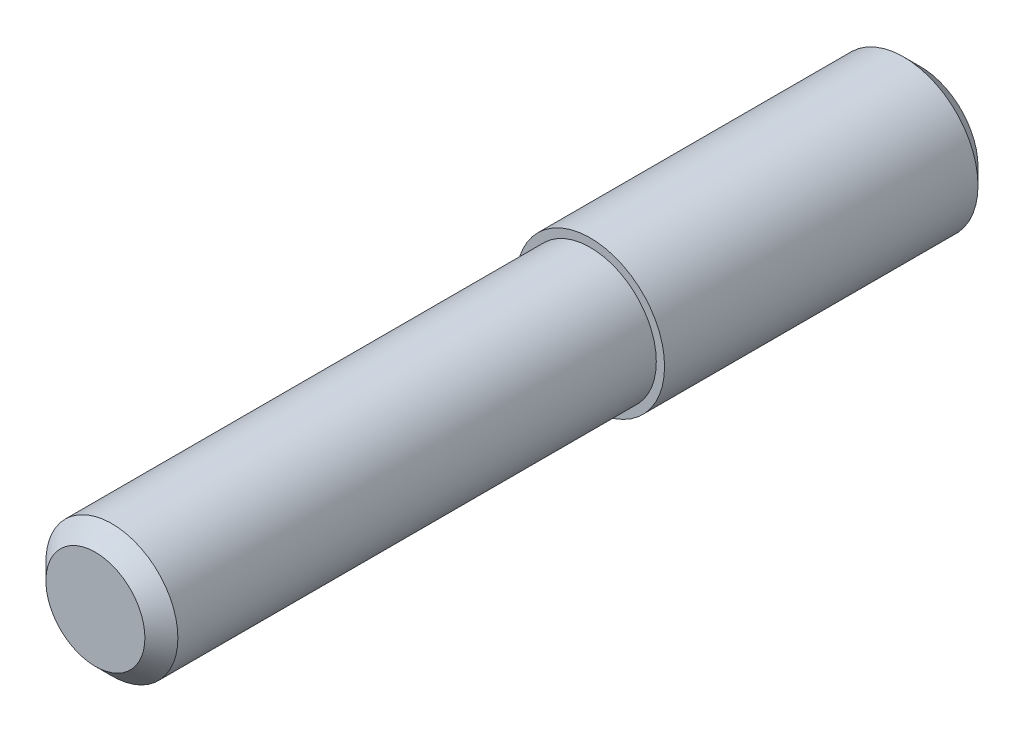
ISO-10303-21;
HEADER;
FILE_DESCRIPTION(('STEP AP214'),'2;1');
FILE_NAME('part.step','',(''),(''),'','','');
FILE_SCHEMA(('AUTOMOTIVE_DESIGN { 1 0 10303 214 1 1 1 1 }'));
ENDSEC;
DATA;
#1=APPLICATION_CONTEXT('core data for automotive mechanical design processes');
#2=APPLICATION_PROTOCOL_DEFINITION('international standard','automotive_design',2000,#1);
#3=PRODUCT_CONTEXT('',#1,'mechanical');
#4=PRODUCT('Part','Part','',(#3));
#5=PRODUCT_RELATED_PRODUCT_CATEGORY('part','',(#4));
#6=PRODUCT_DEFINITION_FORMATION('','',#4);
#7=PRODUCT_DEFINITION_CONTEXT('part definition',#1,'design');
#8=PRODUCT_DEFINITION('design','',#6,#7);
#9=PRODUCT_DEFINITION_SHAPE('','',#8);
#10=(LENGTH_UNIT() NAMED_UNIT(*) SI_UNIT(.MILLI.,.METRE.));
#11=(NAMED_UNIT(*) PLANE_ANGLE_UNIT() SI_UNIT($,.RADIAN.));
#12=(NAMED_UNIT(*) SI_UNIT($,.STERADIAN.) SOLID_ANGLE_UNIT());
#13=UNCERTAINTY_MEASURE_WITH_UNIT(LENGTH_MEASURE(1.E-05),#10,'distance_accuracy_value','');
#14=(GEOMETRIC_REPRESENTATION_CONTEXT(3) GLOBAL_UNCERTAINTY_ASSIGNED_CONTEXT((#13)) GLOBAL_UNIT_ASSIGNED_CONTEXT((#10,
#11,#12)) REPRESENTATION_CONTEXT('',''));
#15=CARTESIAN_POINT('',(0.,0.,0.));
#16=DIRECTION('',(0.,0.,1.));
#17=DIRECTION('',(1.,0.,0.));
#18=AXIS2_PLACEMENT_3D('',#15,#16,#17);
#19=CARTESIAN_POINT('',(0.,0.,20.));
#20=DIRECTION('',(0.,0.,-1.));
#21=DIRECTION('',(-1.,0.,0.));
#22=AXIS2_PLACEMENT_3D('',#19,#20,#21);
#23=CYLINDRICAL_SURFACE('',#22,4.5);
#24=CARTESIAN_POINT('',(0.,0.,1.));
#25=DIRECTION('',(0.,0.,1.));
#26=DIRECTION('',(1.,0.,0.));
#27=AXIS2_PLACEMENT_3D('',#24,#25,#26);
#28=CIRCLE('',#27,4.5);
#29=CARTESIAN_POINT('',(4.5,0.,1.));
#30=VERTEX_POINT('',#29);
#31=EDGE_CURVE('E54',#30,#30,#28,.T.);
#32=ORIENTED_EDGE('',*,*,#31,.T.);
#33=EDGE_LOOP('',(#32));
#34=FACE_BOUND('',#33,.T.);
#35=CARTESIAN_POINT('',(0.,0.,20.));
#36=DIRECTION('',(0.,0.,1.));
#37=DIRECTION('',(1.,0.,0.));
#38=AXIS2_PLACEMENT_3D('',#35,#36,#37);
#39=CIRCLE('',#38,4.5);
#40=CARTESIAN_POINT('',(4.5,0.,20.));
#41=VERTEX_POINT('',#40);
#42=EDGE_CURVE('E60',#41,#41,#39,.T.);
#43=ORIENTED_EDGE('',*,*,#42,.F.);
#44=EDGE_LOOP('',(#43));
#45=FACE_BOUND('',#44,.T.);
#46=ADVANCED_FACE('F39',(#34,#45),#23,.T.);
#47=CARTESIAN_POINT('',(0.,0.,20.));
#48=DIRECTION('',(0.,0.,1.));
#49=DIRECTION('',(1.,0.,0.));
#50=AXIS2_PLACEMENT_3D('',#47,#48,#49);
#51=PLANE('',#50);
#52=CARTESIAN_POINT('',(0.,0.,20.));
#53=DIRECTION('',(0.,0.,1.));
#54=DIRECTION('',(1.,0.,0.));
#55=AXIS2_PLACEMENT_3D('',#52,#53,#54);
#56=CIRCLE('',#55,4.);
#57=CARTESIAN_POINT('',(4.,0.,20.));
#58=VERTEX_POINT('',#57);
#59=EDGE_CURVE('E59',#58,#58,#56,.T.);
#60=ORIENTED_EDGE('',*,*,#59,.F.);
#61=EDGE_LOOP('',(#60));
#62=FACE_BOUND('',#61,.T.);
#63=ORIENTED_EDGE('',*,*,#42,.T.);
#64=EDGE_LOOP('',(#63));
#65=FACE_BOUND('',#64,.T.);
#66=ADVANCED_FACE('F68',(#62,#65),#51,.T.);
#67=CARTESIAN_POINT('',(0.,0.,0.));
#68=DIRECTION('',(0.,0.,1.));
#69=DIRECTION('',(1.,0.,0.));
#70=AXIS2_PLACEMENT_3D('',#67,#68,#69);
#71=PLANE('',#70);
#72=CARTESIAN_POINT('',(0.,0.,0.));
#73=DIRECTION('',(0.,0.,1.));
#74=DIRECTION('',(1.,0.,0.));
#75=AXIS2_PLACEMENT_3D('',#72,#73,#74);
#76=CIRCLE('',#75,3.5);
#77=CARTESIAN_POINT('',(3.5,0.,0.));
#78=VERTEX_POINT('',#77);
#79=EDGE_CURVE('E50',#78,#78,#76,.F.);
#80=ORIENTED_EDGE('',*,*,#79,.T.);
#81=EDGE_LOOP('',(#80));
#82=FACE_BOUND('',#81,.T.);
#83=ADVANCED_FACE('F71',(#82),#71,.F.);
#84=CARTESIAN_POINT('',(0.,0.,50.));
#85=DIRECTION('',(0.,0.,-1.));
#86=DIRECTION('',(-1.,0.,0.));
#87=AXIS2_PLACEMENT_3D('',#84,#85,#86);
#88=CYLINDRICAL_SURFACE('',#87,4.);
#89=CARTESIAN_POINT('',(0.,0.,49.));
#90=DIRECTION('',(0.,0.,1.));
#91=DIRECTION('',(1.,0.,0.));
#92=AXIS2_PLACEMENT_3D('',#89,#90,#91);
#93=CIRCLE('',#92,4.);
#94=CARTESIAN_POINT('',(4.,0.,49.));
#95=VERTEX_POINT('',#94);
#96=EDGE_CURVE('E10',#95,#95,#93,.F.);
#97=ORIENTED_EDGE('',*,*,#96,.T.);
#98=EDGE_LOOP('',(#97));
#99=FACE_BOUND('',#98,.T.);
#100=ORIENTED_EDGE('',*,*,#59,.T.);
#101=EDGE_LOOP('',(#100));
#102=FACE_BOUND('',#101,.T.);
#103=ADVANCED_FACE('F66',(#99,#102),#88,.T.);
#104=CARTESIAN_POINT('',(0.,0.,50.));
#105=DIRECTION('',(0.,0.,1.));
#106=DIRECTION('',(1.,0.,0.));
#107=AXIS2_PLACEMENT_3D('',#104,#105,#106);
#108=PLANE('',#107);
#109=CARTESIAN_POINT('',(0.,0.,50.));
#110=DIRECTION('',(0.,0.,1.));
#111=DIRECTION('',(1.,0.,0.));
#112=AXIS2_PLACEMENT_3D('',#109,#110,#111);
#113=CIRCLE('',#112,2.99999999999999);
#114=CARTESIAN_POINT('',(2.99999999999999,0.,50.));
#115=VERTEX_POINT('',#114);
#116=EDGE_CURVE('E46',#115,#115,#113,.T.);
#117=ORIENTED_EDGE('',*,*,#116,.T.);
#118=EDGE_LOOP('',(#117));
#119=FACE_BOUND('',#118,.T.);
#120=ADVANCED_FACE('F83',(#119),#108,.T.);
#121=CARTESIAN_POINT('',(0.,0.,1.));
#122=DIRECTION('',(0.,0.,1.));
#123=DIRECTION('',(1.,0.,0.));
#124=AXIS2_PLACEMENT_3D('',#121,#122,#123);
#125=CONICAL_SURFACE('',#124,4.5,0.785398163397448);
#126=ORIENTED_EDGE('',*,*,#79,.F.);
#127=EDGE_LOOP('',(#126));
#128=FACE_BOUND('',#127,.T.);
#129=ORIENTED_EDGE('',*,*,#31,.F.);
#130=EDGE_LOOP('',(#129));
#131=FACE_BOUND('',#130,.T.);
#132=ADVANCED_FACE('F81',(#128,#131),#125,.T.);
#133=CARTESIAN_POINT('',(0.,0.,50.));
#134=DIRECTION('',(0.,0.,-1.));
#135=DIRECTION('',(-1.,0.,0.));
#136=AXIS2_PLACEMENT_3D('',#133,#134,#135);
#137=CONICAL_SURFACE('',#136,2.99999999999999,0.78539816339745);
#138=ORIENTED_EDGE('',*,*,#96,.F.);
#139=EDGE_LOOP('',(#138));
#140=FACE_BOUND('',#139,.T.);
#141=ORIENTED_EDGE('',*,*,#116,.F.);
#142=EDGE_LOOP('',(#141));
#143=FACE_BOUND('',#142,.T.);
#144=ADVANCED_FACE('F41',(#140,#143),#137,.T.);
#145=CLOSED_SHELL('',(#46,#66,#83,#103,#120,#132,#144));
#146=MANIFOLD_SOLID_BREP('B2',#145);
#147=ADVANCED_BREP_SHAPE_REPRESENTATION('',(#18,#146),#14);
#148=SHAPE_DEFINITION_REPRESENTATION(#9,#147);
ENDSEC;
END-ISO-10303-21;
